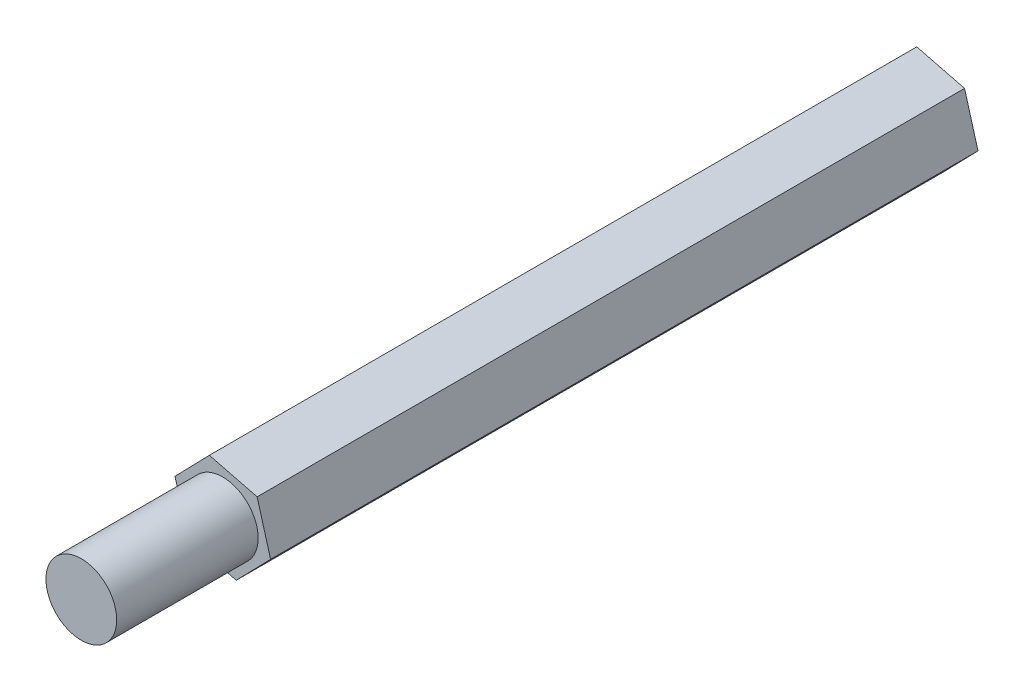
ISO-10303-21;
HEADER;
FILE_DESCRIPTION(('STEP AP214'),'2;1');
FILE_NAME('part.step','',(''),(''),'','','');
FILE_SCHEMA(('AUTOMOTIVE_DESIGN { 1 0 10303 214 1 1 1 1 }'));
ENDSEC;
DATA;
#1=APPLICATION_CONTEXT('core data for automotive mechanical design processes');
#2=APPLICATION_PROTOCOL_DEFINITION('international standard','automotive_design',2000,#1);
#3=PRODUCT_CONTEXT('',#1,'mechanical');
#4=PRODUCT('Part','Part','',(#3));
#5=PRODUCT_RELATED_PRODUCT_CATEGORY('part','',(#4));
#6=PRODUCT_DEFINITION_FORMATION('','',#4);
#7=PRODUCT_DEFINITION_CONTEXT('part definition',#1,'design');
#8=PRODUCT_DEFINITION('design','',#6,#7);
#9=PRODUCT_DEFINITION_SHAPE('','',#8);
#10=(LENGTH_UNIT() NAMED_UNIT(*) SI_UNIT(.MILLI.,.METRE.));
#11=(NAMED_UNIT(*) PLANE_ANGLE_UNIT() SI_UNIT($,.RADIAN.));
#12=(NAMED_UNIT(*) SI_UNIT($,.STERADIAN.) SOLID_ANGLE_UNIT());
#13=UNCERTAINTY_MEASURE_WITH_UNIT(LENGTH_MEASURE(1.E-05),#10,'distance_accuracy_value','');
#14=(GEOMETRIC_REPRESENTATION_CONTEXT(3) GLOBAL_UNCERTAINTY_ASSIGNED_CONTEXT((#13)) GLOBAL_UNIT_ASSIGNED_CONTEXT((#10,
#11,#12)) REPRESENTATION_CONTEXT('',''));
#15=CARTESIAN_POINT('',(0.,0.,0.));
#16=DIRECTION('',(0.,0.,1.));
#17=DIRECTION('',(1.,0.,0.));
#18=AXIS2_PLACEMENT_3D('',#15,#16,#17);
#19=CARTESIAN_POINT('',(0.,0.,6.));
#20=DIRECTION('',(0.,0.,-1.));
#21=DIRECTION('',(-1.,0.,0.));
#22=AXIS2_PLACEMENT_3D('',#19,#20,#21);
#23=CYLINDRICAL_SURFACE('',#22,1.5);
#24=CARTESIAN_POINT('',(0.,0.,6.));
#25=DIRECTION('',(0.,0.,1.));
#26=DIRECTION('',(1.,0.,0.));
#27=AXIS2_PLACEMENT_3D('',#24,#25,#26);
#28=CIRCLE('',#27,1.5);
#29=CARTESIAN_POINT('',(1.5,0.,6.));
#30=VERTEX_POINT('',#29);
#31=EDGE_CURVE('E11',#30,#30,#28,.T.);
#32=ORIENTED_EDGE('',*,*,#31,.F.);
#33=EDGE_LOOP('',(#32));
#34=FACE_BOUND('',#33,.T.);
#35=CARTESIAN_POINT('',(0.,0.,0.));
#36=DIRECTION('',(0.,0.,1.));
#37=DIRECTION('',(1.,0.,0.));
#38=AXIS2_PLACEMENT_3D('',#35,#36,#37);
#39=CIRCLE('',#38,1.5);
#40=CARTESIAN_POINT('',(1.5,0.,0.));
#41=VERTEX_POINT('',#40);
#42=EDGE_CURVE('E42',#41,#41,#39,.T.);
#43=ORIENTED_EDGE('',*,*,#42,.T.);
#44=EDGE_LOOP('',(#43));
#45=FACE_BOUND('',#44,.T.);
#46=ADVANCED_FACE('F39',(#34,#45),#23,.T.);
#47=CARTESIAN_POINT('',(0.,0.,6.));
#48=DIRECTION('',(0.,0.,1.));
#49=DIRECTION('',(1.,0.,0.));
#50=AXIS2_PLACEMENT_3D('',#47,#48,#49);
#51=PLANE('',#50);
#52=ORIENTED_EDGE('',*,*,#31,.T.);
#53=EDGE_LOOP('',(#52));
#54=FACE_BOUND('',#53,.T.);
#55=ADVANCED_FACE('F183',(#54),#51,.T.);
#56=CARTESIAN_POINT('',(0.570223675330632,-2.01078616304609,-30.));
#57=DIRECTION('',(0.244759037278123,0.969583938434773,0.));
#58=DIRECTION('',(-0.969583938434773,0.244759037278123,0.));
#59=AXIS2_PLACEMENT_3D('',#56,#57,#58);
#60=PLANE('',#59);
#61=DIRECTION('',(-0.969583938434773,0.244759037278123,0.));
#62=VECTOR('',#61,1.);
#63=CARTESIAN_POINT('',(0.570223675330632,-2.01078616304609,0.));
#64=LINE('',#63,#62);
#65=CARTESIAN_POINT('',(0.570223675330632,-2.01078616304609,0.));
#66=VERTEX_POINT('',#65);
#67=CARTESIAN_POINT('',(-1.45628006111084,-1.49922127019871,0.));
#68=VERTEX_POINT('',#67);
#69=EDGE_CURVE('E129',#66,#68,#64,.T.);
#70=ORIENTED_EDGE('',*,*,#69,.T.);
#71=DIRECTION('',(0.,0.,1.));
#72=VECTOR('',#71,1.);
#73=CARTESIAN_POINT('',(-1.45628006111084,-1.49922127019871,-30.));
#74=LINE('',#73,#72);
#75=CARTESIAN_POINT('',(-1.45628006111084,-1.49922127019871,-30.));
#76=VERTEX_POINT('',#75);
#77=EDGE_CURVE('E156',#76,#68,#74,.T.);
#78=ORIENTED_EDGE('',*,*,#77,.F.);
#79=DIRECTION('',(-0.969583938434773,0.244759037278123,0.));
#80=VECTOR('',#79,1.);
#81=CARTESIAN_POINT('',(0.570223675330632,-2.01078616304609,-30.));
#82=LINE('',#81,#80);
#83=CARTESIAN_POINT('',(0.570223675330632,-2.01078616304609,-30.));
#84=VERTEX_POINT('',#83);
#85=EDGE_CURVE('E145',#84,#76,#82,.T.);
#86=ORIENTED_EDGE('',*,*,#85,.F.);
#87=DIRECTION('',(0.,0.,1.));
#88=VECTOR('',#87,1.);
#89=CARTESIAN_POINT('',(0.570223675330632,-2.01078616304609,-30.));
#90=LINE('',#89,#88);
#91=EDGE_CURVE('E125',#84,#66,#90,.T.);
#92=ORIENTED_EDGE('',*,*,#91,.T.);
#93=EDGE_LOOP('',(#70,#78,#86,#92));
#94=FACE_BOUND('',#93,.T.);
#95=ADVANCED_FACE('F171',(#94),#60,.F.);
#96=CARTESIAN_POINT('',(-1.45628006111084,-1.49922127019871,-30.));
#97=DIRECTION('',(0.962063840424943,0.272824425128709,0.));
#98=DIRECTION('',(-0.272824425128709,0.962063840424943,0.));
#99=AXIS2_PLACEMENT_3D('',#96,#97,#98);
#100=PLANE('',#99);
#101=DIRECTION('',(-0.272824425128709,0.962063840424942,0.));
#102=VECTOR('',#101,1.);
#103=CARTESIAN_POINT('',(-1.45628006111084,-1.49922127019871,0.));
#104=LINE('',#103,#102);
#105=CARTESIAN_POINT('',(-2.02650373644147,0.511564892847389,0.));
#106=VERTEX_POINT('',#105);
#107=EDGE_CURVE('E133',#68,#106,#104,.T.);
#108=ORIENTED_EDGE('',*,*,#107,.T.);
#109=DIRECTION('',(0.,0.,1.));
#110=VECTOR('',#109,1.);
#111=CARTESIAN_POINT('',(-2.02650373644147,0.511564892847389,-30.));
#112=LINE('',#111,#110);
#113=CARTESIAN_POINT('',(-2.02650373644147,0.511564892847389,-30.));
#114=VERTEX_POINT('',#113);
#115=EDGE_CURVE('E152',#114,#106,#112,.T.);
#116=ORIENTED_EDGE('',*,*,#115,.F.);
#117=DIRECTION('',(-0.272824425128709,0.962063840424942,0.));
#118=VECTOR('',#117,1.);
#119=CARTESIAN_POINT('',(-1.45628006111084,-1.49922127019871,-30.));
#120=LINE('',#119,#118);
#121=EDGE_CURVE('E94',#76,#114,#120,.T.);
#122=ORIENTED_EDGE('',*,*,#121,.F.);
#123=ORIENTED_EDGE('',*,*,#77,.T.);
#124=EDGE_LOOP('',(#108,#116,#122,#123));
#125=FACE_BOUND('',#124,.T.);
#126=ADVANCED_FACE('F193',(#125),#100,.F.);
#127=CARTESIAN_POINT('',(-2.02650373644147,0.511564892847389,-30.));
#128=DIRECTION('',(0.717304803146819,-0.696759513306064,0.));
#129=DIRECTION('',(0.696759513306064,0.717304803146819,0.));
#130=AXIS2_PLACEMENT_3D('',#127,#128,#129);
#131=PLANE('',#130);
#132=DIRECTION('',(0.696759513306064,0.717304803146819,0.));
#133=VECTOR('',#132,1.);
#134=CARTESIAN_POINT('',(-2.02650373644147,0.511564892847389,0.));
#135=LINE('',#134,#133);
#136=CARTESIAN_POINT('',(-0.570223675330633,2.01078616304609,0.));
#137=VERTEX_POINT('',#136);
#138=EDGE_CURVE('E136',#106,#137,#135,.T.);
#139=ORIENTED_EDGE('',*,*,#138,.T.);
#140=DIRECTION('',(0.,0.,1.));
#141=VECTOR('',#140,1.);
#142=CARTESIAN_POINT('',(-0.570223675330633,2.01078616304609,-30.));
#143=LINE('',#142,#141);
#144=CARTESIAN_POINT('',(-0.570223675330633,2.01078616304609,-30.));
#145=VERTEX_POINT('',#144);
#146=EDGE_CURVE('E118',#145,#137,#143,.T.);
#147=ORIENTED_EDGE('',*,*,#146,.F.);
#148=DIRECTION('',(0.696759513306064,0.717304803146819,0.));
#149=VECTOR('',#148,1.);
#150=CARTESIAN_POINT('',(-2.02650373644147,0.511564892847389,-30.));
#151=LINE('',#150,#149);
#152=EDGE_CURVE('E107',#114,#145,#151,.T.);
#153=ORIENTED_EDGE('',*,*,#152,.F.);
#154=ORIENTED_EDGE('',*,*,#115,.T.);
#155=EDGE_LOOP('',(#139,#147,#153,#154));
#156=FACE_BOUND('',#155,.T.);
#157=ADVANCED_FACE('F198',(#156),#131,.F.);
#158=CARTESIAN_POINT('',(-0.570223675330633,2.01078616304609,-30.));
#159=DIRECTION('',(-0.244759037278123,-0.969583938434773,0.));
#160=DIRECTION('',(0.969583938434774,-0.244759037278123,0.));
#161=AXIS2_PLACEMENT_3D('',#158,#159,#160);
#162=PLANE('',#161);
#163=DIRECTION('',(0.969583938434773,-0.244759037278123,0.));
#164=VECTOR('',#163,1.);
#165=CARTESIAN_POINT('',(-0.570223675330633,2.01078616304609,0.));
#166=LINE('',#165,#164);
#167=CARTESIAN_POINT('',(1.45628006111084,1.49922127019871,0.));
#168=VERTEX_POINT('',#167);
#169=EDGE_CURVE('E116',#137,#168,#166,.T.);
#170=ORIENTED_EDGE('',*,*,#169,.T.);
#171=DIRECTION('',(0.,0.,1.));
#172=VECTOR('',#171,1.);
#173=CARTESIAN_POINT('',(1.45628006111084,1.49922127019871,-30.));
#174=LINE('',#173,#172);
#175=CARTESIAN_POINT('',(1.45628006111084,1.49922127019871,-30.));
#176=VERTEX_POINT('',#175);
#177=EDGE_CURVE('E113',#176,#168,#174,.T.);
#178=ORIENTED_EDGE('',*,*,#177,.F.);
#179=DIRECTION('',(0.969583938434773,-0.244759037278123,0.));
#180=VECTOR('',#179,1.);
#181=CARTESIAN_POINT('',(-0.570223675330633,2.01078616304609,-30.));
#182=LINE('',#181,#180);
#183=EDGE_CURVE('E101',#145,#176,#182,.T.);
#184=ORIENTED_EDGE('',*,*,#183,.F.);
#185=ORIENTED_EDGE('',*,*,#146,.T.);
#186=EDGE_LOOP('',(#170,#178,#184,#185));
#187=FACE_BOUND('',#186,.T.);
#188=ADVANCED_FACE('F114',(#187),#162,.F.);
#189=CARTESIAN_POINT('',(1.45628006111084,1.49922127019871,-30.));
#190=DIRECTION('',(-0.962063840424942,-0.27282442512871,0.));
#191=DIRECTION('',(0.27282442512871,-0.962063840424943,0.));
#192=AXIS2_PLACEMENT_3D('',#189,#190,#191);
#193=PLANE('',#192);
#194=DIRECTION('',(0.27282442512871,-0.962063840424942,0.));
#195=VECTOR('',#194,1.);
#196=CARTESIAN_POINT('',(1.45628006111084,1.49922127019871,0.));
#197=LINE('',#196,#195);
#198=CARTESIAN_POINT('',(2.02650373644147,-0.511564892847388,0.));
#199=VERTEX_POINT('',#198);
#200=EDGE_CURVE('E79',#168,#199,#197,.T.);
#201=ORIENTED_EDGE('',*,*,#200,.T.);
#202=DIRECTION('',(0.,0.,1.));
#203=VECTOR('',#202,1.);
#204=CARTESIAN_POINT('',(2.02650373644147,-0.511564892847388,-30.));
#205=LINE('',#204,#203);
#206=CARTESIAN_POINT('',(2.02650373644147,-0.511564892847388,-30.));
#207=VERTEX_POINT('',#206);
#208=EDGE_CURVE('E119',#207,#199,#205,.T.);
#209=ORIENTED_EDGE('',*,*,#208,.F.);
#210=DIRECTION('',(0.27282442512871,-0.962063840424942,0.));
#211=VECTOR('',#210,1.);
#212=CARTESIAN_POINT('',(1.45628006111084,1.49922127019871,-30.));
#213=LINE('',#212,#211);
#214=EDGE_CURVE('E105',#176,#207,#213,.T.);
#215=ORIENTED_EDGE('',*,*,#214,.F.);
#216=ORIENTED_EDGE('',*,*,#177,.T.);
#217=EDGE_LOOP('',(#201,#209,#215,#216));
#218=FACE_BOUND('',#217,.T.);
#219=ADVANCED_FACE('F121',(#218),#193,.F.);
#220=CARTESIAN_POINT('',(2.02650373644147,-0.511564892847388,-30.));
#221=DIRECTION('',(-0.717304803146819,0.696759513306064,0.));
#222=DIRECTION('',(-0.696759513306064,-0.717304803146819,0.));
#223=AXIS2_PLACEMENT_3D('',#220,#221,#222);
#224=PLANE('',#223);
#225=DIRECTION('',(-0.696759513306064,-0.717304803146819,0.));
#226=VECTOR('',#225,1.);
#227=CARTESIAN_POINT('',(2.02650373644147,-0.511564892847388,0.));
#228=LINE('',#227,#226);
#229=EDGE_CURVE('E85',#199,#66,#228,.T.);
#230=ORIENTED_EDGE('',*,*,#229,.T.);
#231=ORIENTED_EDGE('',*,*,#91,.F.);
#232=DIRECTION('',(-0.696759513306064,-0.717304803146819,0.));
#233=VECTOR('',#232,1.);
#234=CARTESIAN_POINT('',(2.02650373644147,-0.511564892847388,-30.));
#235=LINE('',#234,#233);
#236=EDGE_CURVE('E56',#207,#84,#235,.T.);
#237=ORIENTED_EDGE('',*,*,#236,.F.);
#238=ORIENTED_EDGE('',*,*,#208,.T.);
#239=EDGE_LOOP('',(#230,#231,#237,#238));
#240=FACE_BOUND('',#239,.T.);
#241=ADVANCED_FACE('F173',(#240),#224,.F.);
#242=CARTESIAN_POINT('',(0.,0.,-30.));
#243=DIRECTION('',(0.,0.,-1.));
#244=DIRECTION('',(-1.,0.,0.));
#245=AXIS2_PLACEMENT_3D('',#242,#243,#244);
#246=PLANE('',#245);
#247=ORIENTED_EDGE('',*,*,#85,.T.);
#248=ORIENTED_EDGE('',*,*,#121,.T.);
#249=ORIENTED_EDGE('',*,*,#152,.T.);
#250=ORIENTED_EDGE('',*,*,#183,.T.);
#251=ORIENTED_EDGE('',*,*,#214,.T.);
#252=ORIENTED_EDGE('',*,*,#236,.T.);
#253=EDGE_LOOP('',(#247,#248,#249,#250,#251,#252));
#254=FACE_BOUND('',#253,.T.);
#255=ADVANCED_FACE('F103',(#254),#246,.T.);
#256=CARTESIAN_POINT('',(0.,0.,0.));
#257=DIRECTION('',(0.,0.,-1.));
#258=DIRECTION('',(-1.,0.,0.));
#259=AXIS2_PLACEMENT_3D('',#256,#257,#258);
#260=PLANE('',#259);
#261=ORIENTED_EDGE('',*,*,#42,.F.);
#262=EDGE_LOOP('',(#261));
#263=FACE_BOUND('',#262,.T.);
#264=ORIENTED_EDGE('',*,*,#69,.F.);
#265=ORIENTED_EDGE('',*,*,#229,.F.);
#266=ORIENTED_EDGE('',*,*,#200,.F.);
#267=ORIENTED_EDGE('',*,*,#169,.F.);
#268=ORIENTED_EDGE('',*,*,#138,.F.);
#269=ORIENTED_EDGE('',*,*,#107,.F.);
#270=EDGE_LOOP('',(#264,#265,#266,#267,#268,#269));
#271=FACE_BOUND('',#270,.T.);
#272=ADVANCED_FACE('F164',(#263,#271),#260,.F.);
#273=CLOSED_SHELL('',(#46,#55,#95,#126,#157,#188,#219,#241,#255,#272));
#274=MANIFOLD_SOLID_BREP('B2',#273);
#275=ADVANCED_BREP_SHAPE_REPRESENTATION('',(#18,#274),#14);
#276=SHAPE_DEFINITION_REPRESENTATION(#9,#275);
ENDSEC;
END-ISO-10303-21;
